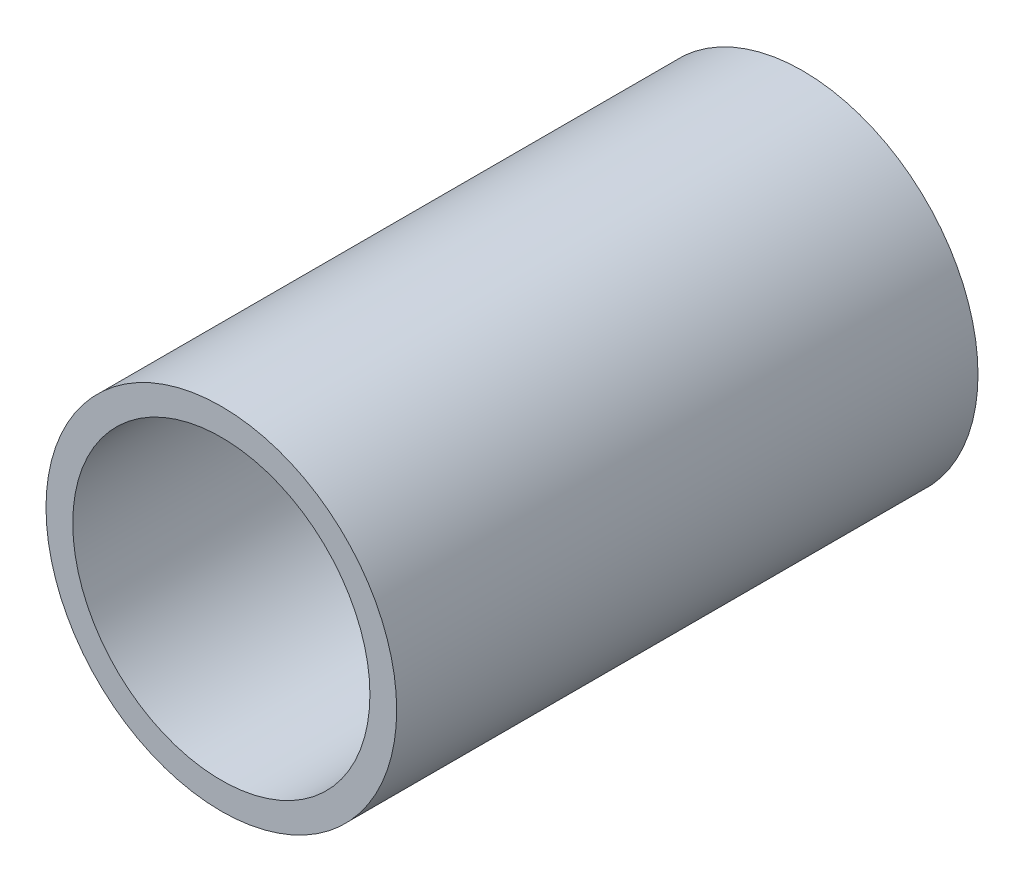
ISO-10303-21;
HEADER;
FILE_DESCRIPTION(('STEP AP214'),'2;1');
FILE_NAME('part.step','',(''),(''),'','','');
FILE_SCHEMA(('AUTOMOTIVE_DESIGN { 1 0 10303 214 1 1 1 1 }'));
ENDSEC;
DATA;
#1=APPLICATION_CONTEXT('core data for automotive mechanical design processes');
#2=APPLICATION_PROTOCOL_DEFINITION('international standard','automotive_design',2000,#1);
#3=PRODUCT_CONTEXT('',#1,'mechanical');
#4=PRODUCT('Part','Part','',(#3));
#5=PRODUCT_RELATED_PRODUCT_CATEGORY('part','',(#4));
#6=PRODUCT_DEFINITION_FORMATION('','',#4);
#7=PRODUCT_DEFINITION_CONTEXT('part definition',#1,'design');
#8=PRODUCT_DEFINITION('design','',#6,#7);
#9=PRODUCT_DEFINITION_SHAPE('','',#8);
#10=(LENGTH_UNIT() NAMED_UNIT(*) SI_UNIT(.MILLI.,.METRE.));
#11=(NAMED_UNIT(*) PLANE_ANGLE_UNIT() SI_UNIT($,.RADIAN.));
#12=(NAMED_UNIT(*) SI_UNIT($,.STERADIAN.) SOLID_ANGLE_UNIT());
#13=UNCERTAINTY_MEASURE_WITH_UNIT(LENGTH_MEASURE(1.E-05),#10,'distance_accuracy_value','');
#14=(GEOMETRIC_REPRESENTATION_CONTEXT(3) GLOBAL_UNCERTAINTY_ASSIGNED_CONTEXT((#13)) GLOBAL_UNIT_ASSIGNED_CONTEXT((#10,
#11,#12)) REPRESENTATION_CONTEXT('',''));
#15=CARTESIAN_POINT('',(0.,0.,0.));
#16=DIRECTION('',(0.,0.,1.));
#17=DIRECTION('',(1.,0.,0.));
#18=AXIS2_PLACEMENT_3D('',#15,#16,#17);
#19=CARTESIAN_POINT('',(0.,0.,40.));
#20=DIRECTION('',(0.,0.,1.));
#21=DIRECTION('',(1.,0.,0.));
#22=AXIS2_PLACEMENT_3D('',#19,#20,#21);
#23=PLANE('',#22);
#24=CARTESIAN_POINT('',(0.,0.,40.));
#25=DIRECTION('',(0.,0.,1.));
#26=DIRECTION('',(1.,0.,0.));
#27=AXIS2_PLACEMENT_3D('',#24,#25,#26);
#28=CIRCLE('',#27,24.13);
#29=CARTESIAN_POINT('',(24.13,0.,40.));
#30=VERTEX_POINT('',#29);
#31=EDGE_CURVE('E11',#30,#30,#28,.T.);
#32=ORIENTED_EDGE('',*,*,#31,.T.);
#33=EDGE_LOOP('',(#32));
#34=FACE_BOUND('',#33,.T.);
#35=CARTESIAN_POINT('',(0.,0.,40.));
#36=DIRECTION('',(0.,0.,1.));
#37=DIRECTION('',(1.,0.,0.));
#38=AXIS2_PLACEMENT_3D('',#35,#36,#37);
#39=CIRCLE('',#38,20.447);
#40=CARTESIAN_POINT('',(20.447,0.,40.));
#41=VERTEX_POINT('',#40);
#42=EDGE_CURVE('E47',#41,#41,#39,.T.);
#43=ORIENTED_EDGE('',*,*,#42,.F.);
#44=EDGE_LOOP('',(#43));
#45=FACE_BOUND('',#44,.T.);
#46=ADVANCED_FACE('F36',(#34,#45),#23,.T.);
#47=CARTESIAN_POINT('',(0.,0.,-40.));
#48=DIRECTION('',(0.,0.,1.));
#49=DIRECTION('',(1.,0.,0.));
#50=AXIS2_PLACEMENT_3D('',#47,#48,#49);
#51=PLANE('',#50);
#52=CARTESIAN_POINT('',(0.,0.,-40.));
#53=DIRECTION('',(0.,0.,1.));
#54=DIRECTION('',(1.,0.,0.));
#55=AXIS2_PLACEMENT_3D('',#52,#53,#54);
#56=CIRCLE('',#55,24.13);
#57=CARTESIAN_POINT('',(24.13,0.,-40.));
#58=VERTEX_POINT('',#57);
#59=EDGE_CURVE('E40',#58,#58,#56,.T.);
#60=ORIENTED_EDGE('',*,*,#59,.F.);
#61=EDGE_LOOP('',(#60));
#62=FACE_BOUND('',#61,.T.);
#63=CARTESIAN_POINT('',(0.,0.,-40.));
#64=DIRECTION('',(0.,0.,1.));
#65=DIRECTION('',(1.,0.,0.));
#66=AXIS2_PLACEMENT_3D('',#63,#64,#65);
#67=CIRCLE('',#66,20.447);
#68=CARTESIAN_POINT('',(20.447,0.,-40.));
#69=VERTEX_POINT('',#68);
#70=EDGE_CURVE('E49',#69,#69,#67,.T.);
#71=ORIENTED_EDGE('',*,*,#70,.T.);
#72=EDGE_LOOP('',(#71));
#73=FACE_BOUND('',#72,.T.);
#74=ADVANCED_FACE('F59',(#62,#73),#51,.F.);
#75=CARTESIAN_POINT('',(0.,0.,40.));
#76=DIRECTION('',(0.,0.,-1.));
#77=DIRECTION('',(-1.,0.,0.));
#78=AXIS2_PLACEMENT_3D('',#75,#76,#77);
#79=CYLINDRICAL_SURFACE('',#78,24.13);
#80=ORIENTED_EDGE('',*,*,#31,.F.);
#81=EDGE_LOOP('',(#80));
#82=FACE_BOUND('',#81,.T.);
#83=ORIENTED_EDGE('',*,*,#59,.T.);
#84=EDGE_LOOP('',(#83));
#85=FACE_BOUND('',#84,.T.);
#86=ADVANCED_FACE('F38',(#82,#85),#79,.T.);
#87=CARTESIAN_POINT('',(0.,0.,40.));
#88=DIRECTION('',(0.,0.,-1.));
#89=DIRECTION('',(-1.,0.,0.));
#90=AXIS2_PLACEMENT_3D('',#87,#88,#89);
#91=CYLINDRICAL_SURFACE('',#90,20.447);
#92=ORIENTED_EDGE('',*,*,#42,.T.);
#93=EDGE_LOOP('',(#92));
#94=FACE_BOUND('',#93,.T.);
#95=ORIENTED_EDGE('',*,*,#70,.F.);
#96=EDGE_LOOP('',(#95));
#97=FACE_BOUND('',#96,.T.);
#98=ADVANCED_FACE('F55',(#94,#97),#91,.F.);
#99=CLOSED_SHELL('',(#46,#74,#86,#98));
#100=MANIFOLD_SOLID_BREP('B2',#99);
#101=ADVANCED_BREP_SHAPE_REPRESENTATION('',(#18,#100),#14);
#102=SHAPE_DEFINITION_REPRESENTATION(#9,#101);
ENDSEC;
END-ISO-10303-21;
